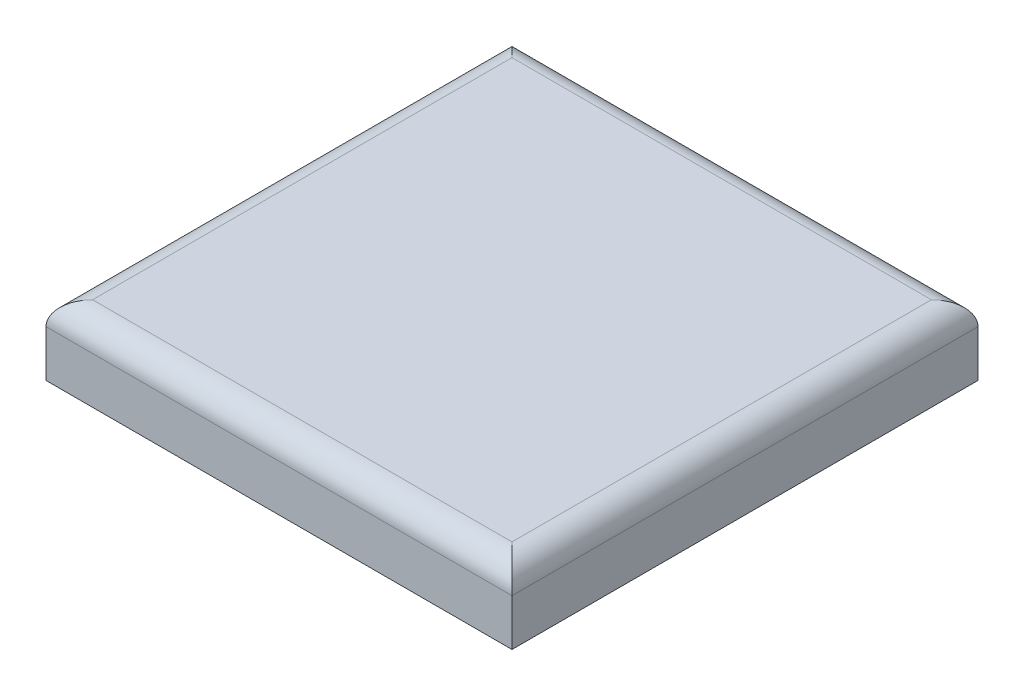
ISO-10303-21;
HEADER;
FILE_DESCRIPTION(('STEP AP214'),'2;1');
FILE_NAME('part.step','',(''),(''),'','','');
FILE_SCHEMA(('AUTOMOTIVE_DESIGN { 1 0 10303 214 1 1 1 1 }'));
ENDSEC;
DATA;
#1=APPLICATION_CONTEXT('core data for automotive mechanical design processes');
#2=APPLICATION_PROTOCOL_DEFINITION('international standard','automotive_design',2000,#1);
#3=PRODUCT_CONTEXT('',#1,'mechanical');
#4=PRODUCT('Part','Part','',(#3));
#5=PRODUCT_RELATED_PRODUCT_CATEGORY('part','',(#4));
#6=PRODUCT_DEFINITION_FORMATION('','',#4);
#7=PRODUCT_DEFINITION_CONTEXT('part definition',#1,'design');
#8=PRODUCT_DEFINITION('design','',#6,#7);
#9=PRODUCT_DEFINITION_SHAPE('','',#8);
#10=(LENGTH_UNIT() NAMED_UNIT(*) SI_UNIT(.MILLI.,.METRE.));
#11=(NAMED_UNIT(*) PLANE_ANGLE_UNIT() SI_UNIT($,.RADIAN.));
#12=(NAMED_UNIT(*) SI_UNIT($,.STERADIAN.) SOLID_ANGLE_UNIT());
#13=UNCERTAINTY_MEASURE_WITH_UNIT(LENGTH_MEASURE(1.E-05),#10,'distance_accuracy_value','');
#14=(GEOMETRIC_REPRESENTATION_CONTEXT(3) GLOBAL_UNCERTAINTY_ASSIGNED_CONTEXT((#13)) GLOBAL_UNIT_ASSIGNED_CONTEXT((#10,
#11,#12)) REPRESENTATION_CONTEXT('',''));
#15=CARTESIAN_POINT('',(0.,0.,0.));
#16=DIRECTION('',(0.,0.,1.));
#17=DIRECTION('',(1.,0.,0.));
#18=AXIS2_PLACEMENT_3D('',#15,#16,#17);
#19=CARTESIAN_POINT('',(10.,3.,-10.));
#20=DIRECTION('',(-1.,0.,0.));
#21=DIRECTION('',(0.,0.,1.));
#22=AXIS2_PLACEMENT_3D('',#19,#20,#21);
#23=PLANE('',#22);
#24=DIRECTION('',(0.,-1.,0.));
#25=VECTOR('',#24,1.);
#26=CARTESIAN_POINT('',(10.,3.,-10.));
#27=LINE('',#26,#25);
#28=CARTESIAN_POINT('',(10.,2.,-10.));
#29=VERTEX_POINT('',#28);
#30=CARTESIAN_POINT('',(10.,0.,-10.));
#31=VERTEX_POINT('',#30);
#32=EDGE_CURVE('E86',#29,#31,#27,.T.);
#33=ORIENTED_EDGE('',*,*,#32,.F.);
#34=DIRECTION('',(0.,0.,-1.));
#35=VECTOR('',#34,1.);
#36=CARTESIAN_POINT('',(10.,2.,10.));
#37=LINE('',#36,#35);
#38=CARTESIAN_POINT('',(10.,2.,10.));
#39=VERTEX_POINT('',#38);
#40=EDGE_CURVE('E49',#29,#39,#37,.F.);
#41=ORIENTED_EDGE('',*,*,#40,.T.);
#42=DIRECTION('',(0.,-1.,0.));
#43=VECTOR('',#42,1.);
#44=CARTESIAN_POINT('',(10.,3.,10.));
#45=LINE('',#44,#43);
#46=CARTESIAN_POINT('',(10.,0.,10.));
#47=VERTEX_POINT('',#46);
#48=EDGE_CURVE('E103',#39,#47,#45,.T.);
#49=ORIENTED_EDGE('',*,*,#48,.T.);
#50=DIRECTION('',(0.,0.,-1.));
#51=VECTOR('',#50,1.);
#52=CARTESIAN_POINT('',(10.,0.,-10.));
#53=LINE('',#52,#51);
#54=EDGE_CURVE('E99',#47,#31,#53,.T.);
#55=ORIENTED_EDGE('',*,*,#54,.T.);
#56=EDGE_LOOP('',(#33,#41,#49,#55));
#57=FACE_BOUND('',#56,.T.);
#58=ADVANCED_FACE('F32',(#57),#23,.F.);
#59=CARTESIAN_POINT('',(-10.,3.,-10.));
#60=DIRECTION('',(0.,0.,1.));
#61=DIRECTION('',(1.,0.,0.));
#62=AXIS2_PLACEMENT_3D('',#59,#60,#61);
#63=PLANE('',#62);
#64=DIRECTION('',(0.,-1.,0.));
#65=VECTOR('',#64,1.);
#66=CARTESIAN_POINT('',(-10.,3.,-10.));
#67=LINE('',#66,#65);
#68=CARTESIAN_POINT('',(-10.,2.,-10.));
#69=VERTEX_POINT('',#68);
#70=CARTESIAN_POINT('',(-10.,0.,-10.));
#71=VERTEX_POINT('',#70);
#72=EDGE_CURVE('E93',#69,#71,#67,.T.);
#73=ORIENTED_EDGE('',*,*,#72,.F.);
#74=DIRECTION('',(-1.,0.,0.));
#75=VECTOR('',#74,1.);
#76=CARTESIAN_POINT('',(10.,2.,-10.));
#77=LINE('',#76,#75);
#78=EDGE_CURVE('E57',#69,#29,#77,.F.);
#79=ORIENTED_EDGE('',*,*,#78,.T.);
#80=ORIENTED_EDGE('',*,*,#32,.T.);
#81=DIRECTION('',(-1.,0.,0.));
#82=VECTOR('',#81,1.);
#83=CARTESIAN_POINT('',(-10.,0.,-10.));
#84=LINE('',#83,#82);
#85=EDGE_CURVE('E89',#31,#71,#84,.T.);
#86=ORIENTED_EDGE('',*,*,#85,.T.);
#87=EDGE_LOOP('',(#73,#79,#80,#86));
#88=FACE_BOUND('',#87,.T.);
#89=ADVANCED_FACE('F88',(#88),#63,.F.);
#90=CARTESIAN_POINT('',(-10.,3.,-10.));
#91=DIRECTION('',(1.,0.,0.));
#92=DIRECTION('',(0.,0.,-1.));
#93=AXIS2_PLACEMENT_3D('',#90,#91,#92);
#94=PLANE('',#93);
#95=DIRECTION('',(0.,-1.,0.));
#96=VECTOR('',#95,1.);
#97=CARTESIAN_POINT('',(-10.,3.,10.));
#98=LINE('',#97,#96);
#99=CARTESIAN_POINT('',(-10.,2.,10.));
#100=VERTEX_POINT('',#99);
#101=CARTESIAN_POINT('',(-10.,0.,10.));
#102=VERTEX_POINT('',#101);
#103=EDGE_CURVE('E114',#100,#102,#98,.T.);
#104=ORIENTED_EDGE('',*,*,#103,.F.);
#105=DIRECTION('',(0.,0.,1.));
#106=VECTOR('',#105,1.);
#107=CARTESIAN_POINT('',(-10.,2.,-10.));
#108=LINE('',#107,#106);
#109=EDGE_CURVE('E125',#100,#69,#108,.F.);
#110=ORIENTED_EDGE('',*,*,#109,.T.);
#111=ORIENTED_EDGE('',*,*,#72,.T.);
#112=DIRECTION('',(0.,0.,1.));
#113=VECTOR('',#112,1.);
#114=CARTESIAN_POINT('',(-10.,0.,-10.));
#115=LINE('',#114,#113);
#116=EDGE_CURVE('E101',#71,#102,#115,.T.);
#117=ORIENTED_EDGE('',*,*,#116,.T.);
#118=EDGE_LOOP('',(#104,#110,#111,#117));
#119=FACE_BOUND('',#118,.T.);
#120=ADVANCED_FACE('F155',(#119),#94,.F.);
#121=CARTESIAN_POINT('',(-10.,3.,10.));
#122=DIRECTION('',(0.,0.,-1.));
#123=DIRECTION('',(-1.,0.,0.));
#124=AXIS2_PLACEMENT_3D('',#121,#122,#123);
#125=PLANE('',#124);
#126=ORIENTED_EDGE('',*,*,#48,.F.);
#127=DIRECTION('',(1.,0.,0.));
#128=VECTOR('',#127,1.);
#129=CARTESIAN_POINT('',(-10.,2.,10.));
#130=LINE('',#129,#128);
#131=EDGE_CURVE('E41',#39,#100,#130,.F.);
#132=ORIENTED_EDGE('',*,*,#131,.T.);
#133=ORIENTED_EDGE('',*,*,#103,.T.);
#134=DIRECTION('',(1.,0.,0.));
#135=VECTOR('',#134,1.);
#136=CARTESIAN_POINT('',(-10.,0.,10.));
#137=LINE('',#136,#135);
#138=EDGE_CURVE('E111',#102,#47,#137,.T.);
#139=ORIENTED_EDGE('',*,*,#138,.T.);
#140=EDGE_LOOP('',(#126,#132,#133,#139));
#141=FACE_BOUND('',#140,.T.);
#142=ADVANCED_FACE('F157',(#141),#125,.F.);
#143=CARTESIAN_POINT('',(0.,3.,0.));
#144=DIRECTION('',(0.,1.,0.));
#145=DIRECTION('',(0.,0.,1.));
#146=AXIS2_PLACEMENT_3D('',#143,#144,#145);
#147=PLANE('',#146);
#148=DIRECTION('',(-1.,0.,0.));
#149=VECTOR('',#148,1.);
#150=CARTESIAN_POINT('',(-10.,3.,-9.));
#151=LINE('',#150,#149);
#152=CARTESIAN_POINT('',(9.,3.,-9.));
#153=VERTEX_POINT('',#152);
#154=CARTESIAN_POINT('',(-9.,3.,-9.));
#155=VERTEX_POINT('',#154);
#156=EDGE_CURVE('E120',#153,#155,#151,.T.);
#157=ORIENTED_EDGE('',*,*,#156,.T.);
#158=DIRECTION('',(0.,0.,1.));
#159=VECTOR('',#158,1.);
#160=CARTESIAN_POINT('',(-9.,3.,10.));
#161=LINE('',#160,#159);
#162=CARTESIAN_POINT('',(-9.,3.,9.));
#163=VERTEX_POINT('',#162);
#164=EDGE_CURVE('E122',#155,#163,#161,.T.);
#165=ORIENTED_EDGE('',*,*,#164,.T.);
#166=DIRECTION('',(1.,0.,0.));
#167=VECTOR('',#166,1.);
#168=CARTESIAN_POINT('',(10.,3.,9.));
#169=LINE('',#168,#167);
#170=CARTESIAN_POINT('',(9.,3.,9.));
#171=VERTEX_POINT('',#170);
#172=EDGE_CURVE('E92',#163,#171,#169,.T.);
#173=ORIENTED_EDGE('',*,*,#172,.T.);
#174=DIRECTION('',(0.,0.,-1.));
#175=VECTOR('',#174,1.);
#176=CARTESIAN_POINT('',(9.,3.,-10.));
#177=LINE('',#176,#175);
#178=EDGE_CURVE('E118',#171,#153,#177,.T.);
#179=ORIENTED_EDGE('',*,*,#178,.T.);
#180=EDGE_LOOP('',(#157,#165,#173,#179));
#181=FACE_BOUND('',#180,.T.);
#182=ADVANCED_FACE('F147',(#181),#147,.T.);
#183=CARTESIAN_POINT('',(0.,0.,0.));
#184=DIRECTION('',(0.,1.,0.));
#185=DIRECTION('',(0.,0.,1.));
#186=AXIS2_PLACEMENT_3D('',#183,#184,#185);
#187=PLANE('',#186);
#188=CARTESIAN_POINT('',(0.,0.,0.));
#189=DIRECTION('',(0.,-1.,0.));
#190=DIRECTION('',(0.,0.,-1.));
#191=AXIS2_PLACEMENT_3D('',#188,#189,#190);
#192=CIRCLE('',#191,2.5);
#193=CARTESIAN_POINT('',(0.,0.,-2.5));
#194=VERTEX_POINT('',#193);
#195=EDGE_CURVE('E11',#194,#194,#192,.T.);
#196=ORIENTED_EDGE('',*,*,#195,.F.);
#197=EDGE_LOOP('',(#196));
#198=FACE_BOUND('',#197,.T.);
#199=ORIENTED_EDGE('',*,*,#54,.F.);
#200=ORIENTED_EDGE('',*,*,#138,.F.);
#201=ORIENTED_EDGE('',*,*,#116,.F.);
#202=ORIENTED_EDGE('',*,*,#85,.F.);
#203=EDGE_LOOP('',(#199,#200,#201,#202));
#204=FACE_BOUND('',#203,.T.);
#205=ADVANCED_FACE('F97',(#198,#204),#187,.F.);
#206=CARTESIAN_POINT('',(9.,2.,0.));
#207=DIRECTION('',(0.,0.,1.));
#208=DIRECTION('',(1.,0.,0.));
#209=AXIS2_PLACEMENT_3D('',#206,#207,#208);
#210=CYLINDRICAL_SURFACE('',#209,1.);
#211=CARTESIAN_POINT('',(9.,2.,9.));
#212=DIRECTION('',(-0.707106781186547,0.,0.707106781186548));
#213=DIRECTION('',(-0.707106781186547,0.,-0.707106781186547));
#214=AXIS2_PLACEMENT_3D('',#211,#212,#213);
#215=ELLIPSE('',#214,1.4142135623731,1.);
#216=EDGE_CURVE('E107',#39,#171,#215,.T.);
#217=ORIENTED_EDGE('',*,*,#216,.F.);
#218=ORIENTED_EDGE('',*,*,#40,.F.);
#219=CARTESIAN_POINT('',(9.,2.,-9.));
#220=DIRECTION('',(0.707106781186547,0.,0.707106781186547));
#221=DIRECTION('',(-0.707106781186547,0.,0.707106781186548));
#222=AXIS2_PLACEMENT_3D('',#219,#220,#221);
#223=ELLIPSE('',#222,1.41421356237309,1.);
#224=EDGE_CURVE('E36',#153,#29,#223,.F.);
#225=ORIENTED_EDGE('',*,*,#224,.F.);
#226=ORIENTED_EDGE('',*,*,#178,.F.);
#227=EDGE_LOOP('',(#217,#218,#225,#226));
#228=FACE_BOUND('',#227,.T.);
#229=ADVANCED_FACE('F34',(#228),#210,.T.);
#230=CARTESIAN_POINT('',(0.,2.,-9.));
#231=DIRECTION('',(1.,0.,0.));
#232=DIRECTION('',(0.,0.,-1.));
#233=AXIS2_PLACEMENT_3D('',#230,#231,#232);
#234=CYLINDRICAL_SURFACE('',#233,1.);
#235=ORIENTED_EDGE('',*,*,#224,.T.);
#236=ORIENTED_EDGE('',*,*,#78,.F.);
#237=CARTESIAN_POINT('',(-9.,2.,-9.));
#238=DIRECTION('',(0.707106781186547,0.,-0.707106781186548));
#239=DIRECTION('',(0.707106781186548,0.,0.707106781186547));
#240=AXIS2_PLACEMENT_3D('',#237,#238,#239);
#241=ELLIPSE('',#240,1.4142135623731,1.);
#242=EDGE_CURVE('E133',#155,#69,#241,.F.);
#243=ORIENTED_EDGE('',*,*,#242,.F.);
#244=ORIENTED_EDGE('',*,*,#156,.F.);
#245=EDGE_LOOP('',(#235,#236,#243,#244));
#246=FACE_BOUND('',#245,.T.);
#247=ADVANCED_FACE('F178',(#246),#234,.T.);
#248=CARTESIAN_POINT('',(0.,2.,9.));
#249=DIRECTION('',(-1.,0.,0.));
#250=DIRECTION('',(0.,0.,1.));
#251=AXIS2_PLACEMENT_3D('',#248,#249,#250);
#252=CYLINDRICAL_SURFACE('',#251,1.);
#253=ORIENTED_EDGE('',*,*,#216,.T.);
#254=ORIENTED_EDGE('',*,*,#172,.F.);
#255=CARTESIAN_POINT('',(-9.,2.,9.));
#256=DIRECTION('',(-0.707106781186548,0.,-0.707106781186547));
#257=DIRECTION('',(-0.707106781186547,0.,0.707106781186548));
#258=AXIS2_PLACEMENT_3D('',#255,#256,#257);
#259=ELLIPSE('',#258,1.41421356237309,1.);
#260=EDGE_CURVE('E131',#100,#163,#259,.T.);
#261=ORIENTED_EDGE('',*,*,#260,.F.);
#262=ORIENTED_EDGE('',*,*,#131,.F.);
#263=EDGE_LOOP('',(#253,#254,#261,#262));
#264=FACE_BOUND('',#263,.T.);
#265=ADVANCED_FACE('F140',(#264),#252,.T.);
#266=CARTESIAN_POINT('',(-9.,2.,0.));
#267=DIRECTION('',(0.,0.,-1.));
#268=DIRECTION('',(-1.,0.,0.));
#269=AXIS2_PLACEMENT_3D('',#266,#267,#268);
#270=CYLINDRICAL_SURFACE('',#269,1.);
#271=ORIENTED_EDGE('',*,*,#242,.T.);
#272=ORIENTED_EDGE('',*,*,#109,.F.);
#273=ORIENTED_EDGE('',*,*,#260,.T.);
#274=ORIENTED_EDGE('',*,*,#164,.F.);
#275=EDGE_LOOP('',(#271,#272,#273,#274));
#276=FACE_BOUND('',#275,.T.);
#277=ADVANCED_FACE('F151',(#276),#270,.T.);
#278=CARTESIAN_POINT('',(0.,-5.,0.));
#279=DIRECTION('',(0.,1.,0.));
#280=DIRECTION('',(0.,0.,1.));
#281=AXIS2_PLACEMENT_3D('',#278,#279,#280);
#282=CYLINDRICAL_SURFACE('',#281,2.5);
#283=CARTESIAN_POINT('',(0.,-5.,0.));
#284=DIRECTION('',(0.,-1.,0.));
#285=DIRECTION('',(0.,0.,-1.));
#286=AXIS2_PLACEMENT_3D('',#283,#284,#285);
#287=CIRCLE('',#286,2.5);
#288=CARTESIAN_POINT('',(0.,-5.,-2.5));
#289=VERTEX_POINT('',#288);
#290=EDGE_CURVE('E134',#289,#289,#287,.T.);
#291=ORIENTED_EDGE('',*,*,#290,.F.);
#292=EDGE_LOOP('',(#291));
#293=FACE_BOUND('',#292,.T.);
#294=ORIENTED_EDGE('',*,*,#195,.T.);
#295=EDGE_LOOP('',(#294));
#296=FACE_BOUND('',#295,.T.);
#297=ADVANCED_FACE('F176',(#293,#296),#282,.T.);
#298=CARTESIAN_POINT('',(0.,-5.,0.));
#299=DIRECTION('',(0.,-1.,0.));
#300=DIRECTION('',(0.,0.,-1.));
#301=AXIS2_PLACEMENT_3D('',#298,#299,#300);
#302=PLANE('',#301);
#303=ORIENTED_EDGE('',*,*,#290,.T.);
#304=EDGE_LOOP('',(#303));
#305=FACE_BOUND('',#304,.T.);
#306=ADVANCED_FACE('F194',(#305),#302,.T.);
#307=CLOSED_SHELL('',(#58,#89,#120,#142,#182,#205,#229,#247,#265,#277,#297,#306));
#308=MANIFOLD_SOLID_BREP('B2',#307);
#309=ADVANCED_BREP_SHAPE_REPRESENTATION('',(#18,#308),#14);
#310=SHAPE_DEFINITION_REPRESENTATION(#9,#309);
ENDSEC;
END-ISO-10303-21;
